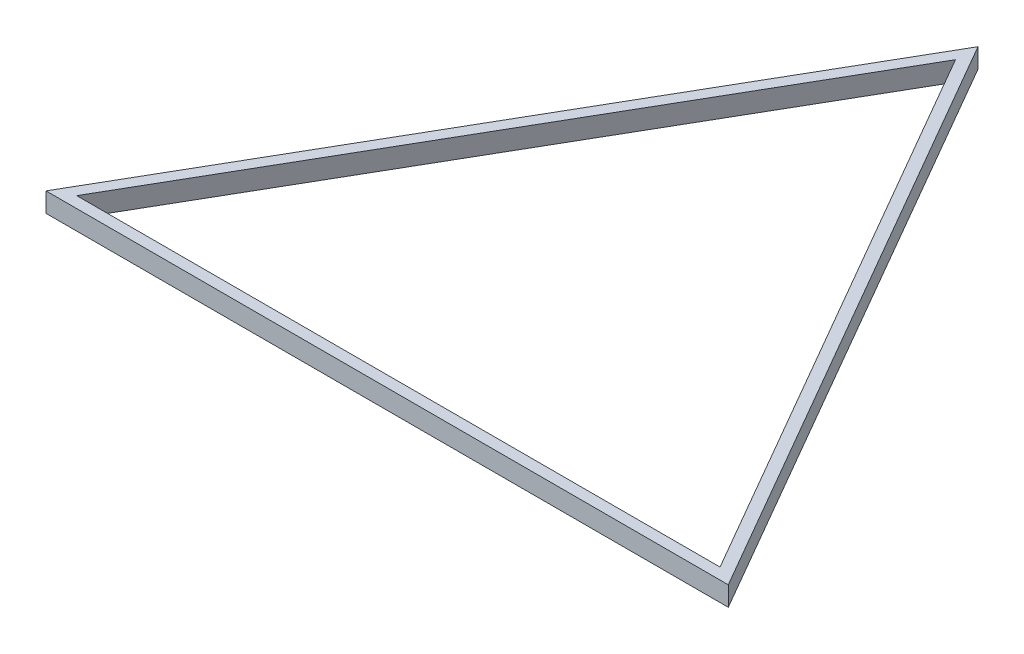
ISO-10303-21;
HEADER;
FILE_DESCRIPTION(('STEP AP214'),'2;1');
FILE_NAME('part.step','',(''),(''),'','','');
FILE_SCHEMA(('AUTOMOTIVE_DESIGN { 1 0 10303 214 1 1 1 1 }'));
ENDSEC;
DATA;
#1=APPLICATION_CONTEXT('core data for automotive mechanical design processes');
#2=APPLICATION_PROTOCOL_DEFINITION('international standard','automotive_design',2000,#1);
#3=PRODUCT_CONTEXT('',#1,'mechanical');
#4=PRODUCT('Part','Part','',(#3));
#5=PRODUCT_RELATED_PRODUCT_CATEGORY('part','',(#4));
#6=PRODUCT_DEFINITION_FORMATION('','',#4);
#7=PRODUCT_DEFINITION_CONTEXT('part definition',#1,'design');
#8=PRODUCT_DEFINITION('design','',#6,#7);
#9=PRODUCT_DEFINITION_SHAPE('','',#8);
#10=(LENGTH_UNIT() NAMED_UNIT(*) SI_UNIT(.MILLI.,.METRE.));
#11=(NAMED_UNIT(*) PLANE_ANGLE_UNIT() SI_UNIT($,.RADIAN.));
#12=(NAMED_UNIT(*) SI_UNIT($,.STERADIAN.) SOLID_ANGLE_UNIT());
#13=UNCERTAINTY_MEASURE_WITH_UNIT(LENGTH_MEASURE(1.E-05),#10,'distance_accuracy_value','');
#14=(GEOMETRIC_REPRESENTATION_CONTEXT(3) GLOBAL_UNCERTAINTY_ASSIGNED_CONTEXT((#13)) GLOBAL_UNIT_ASSIGNED_CONTEXT((#10,
#11,#12)) REPRESENTATION_CONTEXT('',''));
#15=CARTESIAN_POINT('',(0.,0.,0.));
#16=DIRECTION('',(0.,0.,1.));
#17=DIRECTION('',(1.,0.,0.));
#18=AXIS2_PLACEMENT_3D('',#15,#16,#17);
#19=CARTESIAN_POINT('',(0.,20.,0.));
#20=DIRECTION('',(0.,1.,0.));
#21=DIRECTION('',(0.,0.,1.));
#22=AXIS2_PLACEMENT_3D('',#19,#20,#21);
#23=PLANE('',#22);
#24=DIRECTION('',(-0.5,0.,-0.866025403784438));
#25=VECTOR('',#24,1.);
#26=CARTESIAN_POINT('',(350.,20.,202.072594216369));
#27=LINE('',#26,#25);
#28=CARTESIAN_POINT('',(350.,20.,202.072594216369));
#29=VERTEX_POINT('',#28);
#30=CARTESIAN_POINT('',(0.,20.,-404.145188432738));
#31=VERTEX_POINT('',#30);
#32=EDGE_CURVE('E113',#29,#31,#27,.T.);
#33=ORIENTED_EDGE('',*,*,#32,.T.);
#34=DIRECTION('',(-0.5,0.,0.866025403784439));
#35=VECTOR('',#34,1.);
#36=CARTESIAN_POINT('',(0.,20.,-404.145188432738));
#37=LINE('',#36,#35);
#38=CARTESIAN_POINT('',(-350.,20.,202.072594216369));
#39=VERTEX_POINT('',#38);
#40=EDGE_CURVE('E116',#31,#39,#37,.T.);
#41=ORIENTED_EDGE('',*,*,#40,.T.);
#42=DIRECTION('',(1.,0.,0.));
#43=VECTOR('',#42,1.);
#44=CARTESIAN_POINT('',(-350.,20.,202.072594216369));
#45=LINE('',#44,#43);
#46=EDGE_CURVE('E119',#39,#29,#45,.T.);
#47=ORIENTED_EDGE('',*,*,#46,.T.);
#48=EDGE_LOOP('',(#33,#41,#47));
#49=FACE_BOUND('',#48,.T.);
#50=DIRECTION('',(-0.5,0.,0.866025403784439));
#51=VECTOR('',#50,1.);
#52=CARTESIAN_POINT('',(0.,20.,-381.051177665153));
#53=LINE('',#52,#51);
#54=CARTESIAN_POINT('',(0.,20.,-381.051177665153));
#55=VERTEX_POINT('',#54);
#56=CARTESIAN_POINT('',(-330.,20.,190.525588832577));
#57=VERTEX_POINT('',#56);
#58=EDGE_CURVE('E94',#55,#57,#53,.T.);
#59=ORIENTED_EDGE('',*,*,#58,.F.);
#60=DIRECTION('',(-0.5,0.,-0.866025403784439));
#61=VECTOR('',#60,1.);
#62=CARTESIAN_POINT('',(330.,20.,190.525588832576));
#63=LINE('',#62,#61);
#64=CARTESIAN_POINT('',(330.,20.,190.525588832576));
#65=VERTEX_POINT('',#64);
#66=EDGE_CURVE('E86',#65,#55,#63,.T.);
#67=ORIENTED_EDGE('',*,*,#66,.F.);
#68=DIRECTION('',(1.,0.,0.));
#69=VECTOR('',#68,1.);
#70=CARTESIAN_POINT('',(-330.,20.,190.525588832577));
#71=LINE('',#70,#69);
#72=EDGE_CURVE('E103',#57,#65,#71,.T.);
#73=ORIENTED_EDGE('',*,*,#72,.F.);
#74=EDGE_LOOP('',(#59,#67,#73));
#75=FACE_BOUND('',#74,.T.);
#76=ADVANCED_FACE('F33',(#49,#75),#23,.T.);
#77=CARTESIAN_POINT('',(0.,0.,0.));
#78=DIRECTION('',(0.,1.,0.));
#79=DIRECTION('',(0.,0.,1.));
#80=AXIS2_PLACEMENT_3D('',#77,#78,#79);
#81=PLANE('',#80);
#82=DIRECTION('',(-0.5,0.,-0.866025403784438));
#83=VECTOR('',#82,1.);
#84=CARTESIAN_POINT('',(350.,0.,202.072594216369));
#85=LINE('',#84,#83);
#86=CARTESIAN_POINT('',(350.,0.,202.072594216369));
#87=VERTEX_POINT('',#86);
#88=CARTESIAN_POINT('',(0.,0.,-404.145188432738));
#89=VERTEX_POINT('',#88);
#90=EDGE_CURVE('E101',#87,#89,#85,.T.);
#91=ORIENTED_EDGE('',*,*,#90,.F.);
#92=DIRECTION('',(1.,0.,0.));
#93=VECTOR('',#92,1.);
#94=CARTESIAN_POINT('',(-350.,0.,202.072594216369));
#95=LINE('',#94,#93);
#96=CARTESIAN_POINT('',(-350.,0.,202.072594216369));
#97=VERTEX_POINT('',#96);
#98=EDGE_CURVE('E117',#97,#87,#95,.T.);
#99=ORIENTED_EDGE('',*,*,#98,.F.);
#100=DIRECTION('',(-0.5,0.,0.866025403784439));
#101=VECTOR('',#100,1.);
#102=CARTESIAN_POINT('',(0.,0.,-404.145188432738));
#103=LINE('',#102,#101);
#104=EDGE_CURVE('E124',#89,#97,#103,.T.);
#105=ORIENTED_EDGE('',*,*,#104,.F.);
#106=EDGE_LOOP('',(#91,#99,#105));
#107=FACE_BOUND('',#106,.T.);
#108=DIRECTION('',(-0.5,0.,-0.866025403784439));
#109=VECTOR('',#108,1.);
#110=CARTESIAN_POINT('',(330.,0.,190.525588832576));
#111=LINE('',#110,#109);
#112=CARTESIAN_POINT('',(330.,0.,190.525588832576));
#113=VERTEX_POINT('',#112);
#114=CARTESIAN_POINT('',(0.,0.,-381.051177665153));
#115=VERTEX_POINT('',#114);
#116=EDGE_CURVE('E56',#113,#115,#111,.T.);
#117=ORIENTED_EDGE('',*,*,#116,.T.);
#118=DIRECTION('',(-0.5,0.,0.866025403784439));
#119=VECTOR('',#118,1.);
#120=CARTESIAN_POINT('',(0.,0.,-381.051177665153));
#121=LINE('',#120,#119);
#122=CARTESIAN_POINT('',(-330.,0.,190.525588832577));
#123=VERTEX_POINT('',#122);
#124=EDGE_CURVE('E100',#115,#123,#121,.T.);
#125=ORIENTED_EDGE('',*,*,#124,.T.);
#126=DIRECTION('',(1.,0.,0.));
#127=VECTOR('',#126,1.);
#128=CARTESIAN_POINT('',(-330.,0.,190.525588832577));
#129=LINE('',#128,#127);
#130=EDGE_CURVE('E95',#123,#113,#129,.T.);
#131=ORIENTED_EDGE('',*,*,#130,.T.);
#132=EDGE_LOOP('',(#117,#125,#131));
#133=FACE_BOUND('',#132,.T.);
#134=ADVANCED_FACE('F138',(#107,#133),#81,.F.);
#135=CARTESIAN_POINT('',(350.,20.,202.072594216369));
#136=DIRECTION('',(-0.866025403784439,0.,0.5));
#137=DIRECTION('',(0.5,0.,0.866025403784439));
#138=AXIS2_PLACEMENT_3D('',#135,#136,#137);
#139=PLANE('',#138);
#140=ORIENTED_EDGE('',*,*,#90,.T.);
#141=DIRECTION('',(0.,-1.,0.));
#142=VECTOR('',#141,1.);
#143=CARTESIAN_POINT('',(0.,20.,-404.145188432738));
#144=LINE('',#143,#142);
#145=EDGE_CURVE('E11',#31,#89,#144,.T.);
#146=ORIENTED_EDGE('',*,*,#145,.F.);
#147=ORIENTED_EDGE('',*,*,#32,.F.);
#148=DIRECTION('',(0.,-1.,0.));
#149=VECTOR('',#148,1.);
#150=CARTESIAN_POINT('',(350.,20.,202.072594216369));
#151=LINE('',#150,#149);
#152=EDGE_CURVE('E121',#29,#87,#151,.T.);
#153=ORIENTED_EDGE('',*,*,#152,.T.);
#154=EDGE_LOOP('',(#140,#146,#147,#153));
#155=FACE_BOUND('',#154,.T.);
#156=ADVANCED_FACE('F35',(#155),#139,.F.);
#157=CARTESIAN_POINT('',(0.,20.,-404.145188432738));
#158=DIRECTION('',(0.866025403784439,0.,0.5));
#159=DIRECTION('',(0.5,0.,-0.866025403784439));
#160=AXIS2_PLACEMENT_3D('',#157,#158,#159);
#161=PLANE('',#160);
#162=ORIENTED_EDGE('',*,*,#104,.T.);
#163=DIRECTION('',(0.,-1.,0.));
#164=VECTOR('',#163,1.);
#165=CARTESIAN_POINT('',(-350.,20.,202.072594216369));
#166=LINE('',#165,#164);
#167=EDGE_CURVE('E41',#39,#97,#166,.T.);
#168=ORIENTED_EDGE('',*,*,#167,.F.);
#169=ORIENTED_EDGE('',*,*,#40,.F.);
#170=ORIENTED_EDGE('',*,*,#145,.T.);
#171=EDGE_LOOP('',(#162,#168,#169,#170));
#172=FACE_BOUND('',#171,.T.);
#173=ADVANCED_FACE('F144',(#172),#161,.F.);
#174=CARTESIAN_POINT('',(-350.,20.,202.072594216369));
#175=DIRECTION('',(0.,0.,-1.));
#176=DIRECTION('',(-1.,0.,0.));
#177=AXIS2_PLACEMENT_3D('',#174,#175,#176);
#178=PLANE('',#177);
#179=ORIENTED_EDGE('',*,*,#98,.T.);
#180=ORIENTED_EDGE('',*,*,#152,.F.);
#181=ORIENTED_EDGE('',*,*,#46,.F.);
#182=ORIENTED_EDGE('',*,*,#167,.T.);
#183=EDGE_LOOP('',(#179,#180,#181,#182));
#184=FACE_BOUND('',#183,.T.);
#185=ADVANCED_FACE('F133',(#184),#178,.F.);
#186=CARTESIAN_POINT('',(330.,20.,190.525588832576));
#187=DIRECTION('',(-0.866025403784438,0.,0.5));
#188=DIRECTION('',(0.5,0.,0.866025403784439));
#189=AXIS2_PLACEMENT_3D('',#186,#187,#188);
#190=PLANE('',#189);
#191=ORIENTED_EDGE('',*,*,#116,.F.);
#192=DIRECTION('',(0.,-1.,0.));
#193=VECTOR('',#192,1.);
#194=CARTESIAN_POINT('',(330.,20.,190.525588832576));
#195=LINE('',#194,#193);
#196=EDGE_CURVE('E90',#65,#113,#195,.T.);
#197=ORIENTED_EDGE('',*,*,#196,.F.);
#198=ORIENTED_EDGE('',*,*,#66,.T.);
#199=DIRECTION('',(0.,-1.,0.));
#200=VECTOR('',#199,1.);
#201=CARTESIAN_POINT('',(0.,20.,-381.051177665153));
#202=LINE('',#201,#200);
#203=EDGE_CURVE('E89',#55,#115,#202,.T.);
#204=ORIENTED_EDGE('',*,*,#203,.T.);
#205=EDGE_LOOP('',(#191,#197,#198,#204));
#206=FACE_BOUND('',#205,.T.);
#207=ADVANCED_FACE('F88',(#206),#190,.T.);
#208=CARTESIAN_POINT('',(0.,20.,-381.051177665153));
#209=DIRECTION('',(0.866025403784439,0.,0.5));
#210=DIRECTION('',(0.5,0.,-0.866025403784439));
#211=AXIS2_PLACEMENT_3D('',#208,#209,#210);
#212=PLANE('',#211);
#213=ORIENTED_EDGE('',*,*,#124,.F.);
#214=ORIENTED_EDGE('',*,*,#203,.F.);
#215=ORIENTED_EDGE('',*,*,#58,.T.);
#216=DIRECTION('',(0.,-1.,0.));
#217=VECTOR('',#216,1.);
#218=CARTESIAN_POINT('',(-330.,20.,190.525588832577));
#219=LINE('',#218,#217);
#220=EDGE_CURVE('E48',#57,#123,#219,.T.);
#221=ORIENTED_EDGE('',*,*,#220,.T.);
#222=EDGE_LOOP('',(#213,#214,#215,#221));
#223=FACE_BOUND('',#222,.T.);
#224=ADVANCED_FACE('F98',(#223),#212,.T.);
#225=CARTESIAN_POINT('',(-330.,20.,190.525588832577));
#226=DIRECTION('',(0.,0.,-1.));
#227=DIRECTION('',(-1.,0.,0.));
#228=AXIS2_PLACEMENT_3D('',#225,#226,#227);
#229=PLANE('',#228);
#230=ORIENTED_EDGE('',*,*,#130,.F.);
#231=ORIENTED_EDGE('',*,*,#220,.F.);
#232=ORIENTED_EDGE('',*,*,#72,.T.);
#233=ORIENTED_EDGE('',*,*,#196,.T.);
#234=EDGE_LOOP('',(#230,#231,#232,#233));
#235=FACE_BOUND('',#234,.T.);
#236=ADVANCED_FACE('F162',(#235),#229,.T.);
#237=CLOSED_SHELL('',(#76,#134,#156,#173,#185,#207,#224,#236));
#238=MANIFOLD_SOLID_BREP('B2',#237);
#239=ADVANCED_BREP_SHAPE_REPRESENTATION('',(#18,#238),#14);
#240=SHAPE_DEFINITION_REPRESENTATION(#9,#239);
ENDSEC;
END-ISO-10303-21;
